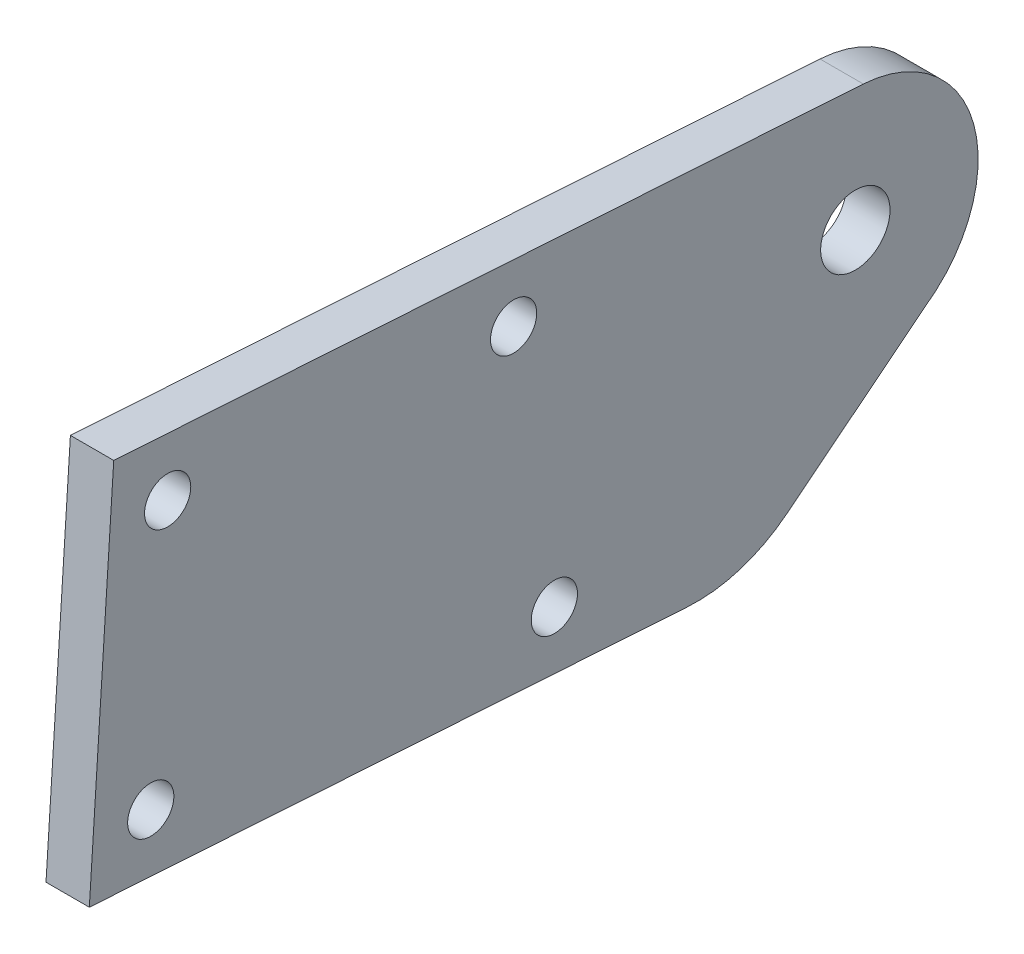
ISO-10303-21;
HEADER;
FILE_DESCRIPTION(('STEP AP214'),'2;1');
FILE_NAME('part.step','',(''),(''),'','','');
FILE_SCHEMA(('AUTOMOTIVE_DESIGN { 1 0 10303 214 1 1 1 1 }'));
ENDSEC;
DATA;
#1=APPLICATION_CONTEXT('core data for automotive mechanical design processes');
#2=APPLICATION_PROTOCOL_DEFINITION('international standard','automotive_design',2000,#1);
#3=PRODUCT_CONTEXT('',#1,'mechanical');
#4=PRODUCT('Part','Part','',(#3));
#5=PRODUCT_RELATED_PRODUCT_CATEGORY('part','',(#4));
#6=PRODUCT_DEFINITION_FORMATION('','',#4);
#7=PRODUCT_DEFINITION_CONTEXT('part definition',#1,'design');
#8=PRODUCT_DEFINITION('design','',#6,#7);
#9=PRODUCT_DEFINITION_SHAPE('','',#8);
#10=(LENGTH_UNIT() NAMED_UNIT(*) SI_UNIT(.MILLI.,.METRE.));
#11=(NAMED_UNIT(*) PLANE_ANGLE_UNIT() SI_UNIT($,.RADIAN.));
#12=(NAMED_UNIT(*) SI_UNIT($,.STERADIAN.) SOLID_ANGLE_UNIT());
#13=UNCERTAINTY_MEASURE_WITH_UNIT(LENGTH_MEASURE(1.E-05),#10,'distance_accuracy_value','');
#14=(GEOMETRIC_REPRESENTATION_CONTEXT(3) GLOBAL_UNCERTAINTY_ASSIGNED_CONTEXT((#13)) GLOBAL_UNIT_ASSIGNED_CONTEXT((#10,
#11,#12)) REPRESENTATION_CONTEXT('',''));
#15=CARTESIAN_POINT('',(0.,0.,0.));
#16=DIRECTION('',(0.,0.,1.));
#17=DIRECTION('',(1.,0.,0.));
#18=AXIS2_PLACEMENT_3D('',#15,#16,#17);
#19=CARTESIAN_POINT('',(3.,-0.106760715950924,-0.0387879175808812));
#20=DIRECTION('',(1.,0.,0.));
#21=DIRECTION('',(0.,0.,-1.));
#22=AXIS2_PLACEMENT_3D('',#19,#20,#21);
#23=PLANE('',#22);
#24=CARTESIAN_POINT('',(3.,-10.4594899761032,48.7369334698677));
#25=DIRECTION('',(1.,0.,0.));
#26=DIRECTION('',(0.,0.,-1.));
#27=AXIS2_PLACEMENT_3D('',#24,#25,#26);
#28=CIRCLE('',#27,1.6);
#29=CARTESIAN_POINT('',(3.,-10.4594899761032,47.1369334698677));
#30=VERTEX_POINT('',#29);
#31=EDGE_CURVE('E195',#30,#30,#28,.T.);
#32=ORIENTED_EDGE('',*,*,#31,.F.);
#33=EDGE_LOOP('',(#32));
#34=FACE_BOUND('',#33,.T.);
#35=CARTESIAN_POINT('',(3.,7.50247542921498,47.5674041721783));
#36=DIRECTION('',(1.,0.,0.));
#37=DIRECTION('',(0.,0.,-1.));
#38=AXIS2_PLACEMENT_3D('',#35,#36,#37);
#39=CIRCLE('',#38,1.60000000000002);
#40=CARTESIAN_POINT('',(3.,7.50247542921498,45.9674041721783));
#41=VERTEX_POINT('',#40);
#42=EDGE_CURVE('E207',#41,#41,#39,.T.);
#43=ORIENTED_EDGE('',*,*,#42,.F.);
#44=EDGE_LOOP('',(#43));
#45=FACE_BOUND('',#44,.T.);
#46=DIRECTION('',(0.,0.0649738498715913,0.997886966962122));
#47=VECTOR('',#46,1.);
#48=CARTESIAN_POINT('',(3.,11.7539186965499,51.2990566405408));
#49=LINE('',#48,#47);
#50=CARTESIAN_POINT('',(3.,8.37527850322711,-0.591065641489519));
#51=VERTEX_POINT('',#50);
#52=CARTESIAN_POINT('',(3.,11.7539186965499,51.2990566405408));
#53=VERTEX_POINT('',#52);
#54=EDGE_CURVE('E131',#51,#53,#49,.T.);
#55=ORIENTED_EDGE('',*,*,#54,.T.);
#56=DIRECTION('',(0.,-0.997886966962122,0.0649738498716033));
#57=VECTOR('',#56,1.);
#58=CARTESIAN_POINT('',(3.,11.7539186965499,51.2990566405408));
#59=LINE('',#58,#57);
#60=CARTESIAN_POINT('',(3.,-14.1911424444653,52.9883767372025));
#61=VERTEX_POINT('',#60);
#62=EDGE_CURVE('E89',#53,#61,#59,.T.);
#63=ORIENTED_EDGE('',*,*,#62,.T.);
#64=DIRECTION('',(0.,-0.0649738498715905,-0.997886966962122));
#65=VECTOR('',#64,1.);
#66=CARTESIAN_POINT('',(3.,-14.1911424444653,52.9883767372025));
#67=LINE('',#66,#65);
#68=CARTESIAN_POINT('',(3.,-16.8875572141363,11.5760676082744));
#69=VERTEX_POINT('',#68);
#70=EDGE_CURVE('E102',#61,#69,#67,.T.);
#71=ORIENTED_EDGE('',*,*,#70,.T.);
#72=CARTESIAN_POINT('',(3.,-6.90868754451549,10.9263291095586));
#73=DIRECTION('',(1.,0.,0.));
#74=DIRECTION('',(0.,0.,-1.));
#75=AXIS2_PLACEMENT_3D('',#72,#73,#74);
#76=CIRCLE('',#75,9.9999999999996);
#77=CARTESIAN_POINT('',(3.,-14.7317466496103,4.69738487813494));
#78=VERTEX_POINT('',#77);
#79=EDGE_CURVE('E96',#69,#78,#76,.T.);
#80=ORIENTED_EDGE('',*,*,#79,.T.);
#81=DIRECTION('',(0.,0.622894423142384,-0.782305910509512));
#82=VECTOR('',#81,1.);
#83=CARTESIAN_POINT('',(3.,-14.7317466496103,4.69738487813494));
#84=LINE('',#83,#82);
#85=CARTESIAN_POINT('',(3.,-6.50684666475155,-5.63243608742181));
#86=VERTEX_POINT('',#85);
#87=EDGE_CURVE('E100',#78,#86,#84,.T.);
#88=ORIENTED_EDGE('',*,*,#87,.T.);
#89=CARTESIAN_POINT('',(3.,-0.106760715950924,-0.0387879175808812));
#90=DIRECTION('',(1.,0.,0.));
#91=DIRECTION('',(0.,0.,-1.));
#92=AXIS2_PLACEMENT_3D('',#89,#90,#91);
#93=CIRCLE('',#92,8.5);
#94=EDGE_CURVE('E52',#86,#51,#93,.T.);
#95=ORIENTED_EDGE('',*,*,#94,.T.);
#96=EDGE_LOOP('',(#55,#63,#71,#80,#88,#95));
#97=FACE_BOUND('',#96,.T.);
#98=CARTESIAN_POINT('',(3.,-0.106760715950924,-0.0387879175808812));
#99=DIRECTION('',(1.,0.,0.));
#100=DIRECTION('',(0.,0.,-1.));
#101=AXIS2_PLACEMENT_3D('',#98,#99,#100);
#102=CIRCLE('',#101,2.40000000000007);
#103=CARTESIAN_POINT('',(3.,-0.106760715950924,-2.43878791758095));
#104=VERTEX_POINT('',#103);
#105=EDGE_CURVE('E124',#104,#104,#102,.T.);
#106=ORIENTED_EDGE('',*,*,#105,.F.);
#107=EDGE_LOOP('',(#106));
#108=FACE_BOUND('',#107,.T.);
#109=CARTESIAN_POINT('',(3.,5.94310303229625,23.6181169650874));
#110=DIRECTION('',(1.,0.,0.));
#111=DIRECTION('',(0.,0.,-1.));
#112=AXIS2_PLACEMENT_3D('',#109,#110,#111);
#113=CIRCLE('',#112,1.60000000000002);
#114=CARTESIAN_POINT('',(3.,5.94310303229625,22.0181169650874));
#115=VERTEX_POINT('',#114);
#116=EDGE_CURVE('E201',#115,#115,#113,.T.);
#117=ORIENTED_EDGE('',*,*,#116,.F.);
#118=EDGE_LOOP('',(#117));
#119=FACE_BOUND('',#118,.T.);
#120=CARTESIAN_POINT('',(3.,-12.2787577725077,20.7960983949283));
#121=DIRECTION('',(1.,0.,0.));
#122=DIRECTION('',(0.,0.,-1.));
#123=AXIS2_PLACEMENT_3D('',#120,#121,#122);
#124=CIRCLE('',#123,1.6);
#125=CARTESIAN_POINT('',(3.,-12.2787577725077,19.1960983949283));
#126=VERTEX_POINT('',#125);
#127=EDGE_CURVE('E186',#126,#126,#124,.T.);
#128=ORIENTED_EDGE('',*,*,#127,.F.);
#129=EDGE_LOOP('',(#128));
#130=FACE_BOUND('',#129,.T.);
#131=ADVANCED_FACE('F35',(#34,#45,#97,#108,#119,#130),#23,.T.);
#132=CARTESIAN_POINT('',(0.,-0.106760715950924,-0.0387879175808812));
#133=DIRECTION('',(1.,0.,0.));
#134=DIRECTION('',(0.,0.,-1.));
#135=AXIS2_PLACEMENT_3D('',#132,#133,#134);
#136=PLANE('',#135);
#137=DIRECTION('',(0.,0.0649738498715913,0.997886966962122));
#138=VECTOR('',#137,1.);
#139=CARTESIAN_POINT('',(0.,11.7539186965499,51.2990566405408));
#140=LINE('',#139,#138);
#141=CARTESIAN_POINT('',(0.,8.37527850322711,-0.591065641489519));
#142=VERTEX_POINT('',#141);
#143=CARTESIAN_POINT('',(0.,11.7539186965499,51.2990566405408));
#144=VERTEX_POINT('',#143);
#145=EDGE_CURVE('E120',#142,#144,#140,.T.);
#146=ORIENTED_EDGE('',*,*,#145,.F.);
#147=CARTESIAN_POINT('',(0.,-0.106760715950924,-0.0387879175808812));
#148=DIRECTION('',(1.,0.,0.));
#149=DIRECTION('',(0.,0.,-1.));
#150=AXIS2_PLACEMENT_3D('',#147,#148,#149);
#151=CIRCLE('',#150,8.5);
#152=CARTESIAN_POINT('',(0.,-6.50684666475155,-5.63243608742181));
#153=VERTEX_POINT('',#152);
#154=EDGE_CURVE('E81',#153,#142,#151,.T.);
#155=ORIENTED_EDGE('',*,*,#154,.F.);
#156=DIRECTION('',(0.,0.622894423142384,-0.782305910509512));
#157=VECTOR('',#156,1.);
#158=CARTESIAN_POINT('',(0.,-14.7317466496103,4.69738487813494));
#159=LINE('',#158,#157);
#160=CARTESIAN_POINT('',(0.,-14.7317466496103,4.69738487813494));
#161=VERTEX_POINT('',#160);
#162=EDGE_CURVE('E75',#161,#153,#159,.T.);
#163=ORIENTED_EDGE('',*,*,#162,.F.);
#164=CARTESIAN_POINT('',(0.,-6.90868754451549,10.9263291095586));
#165=DIRECTION('',(1.,0.,0.));
#166=DIRECTION('',(0.,0.,-1.));
#167=AXIS2_PLACEMENT_3D('',#164,#165,#166);
#168=CIRCLE('',#167,9.9999999999996);
#169=CARTESIAN_POINT('',(0.,-16.8875572141363,11.5760676082744));
#170=VERTEX_POINT('',#169);
#171=EDGE_CURVE('E110',#170,#161,#168,.T.);
#172=ORIENTED_EDGE('',*,*,#171,.F.);
#173=DIRECTION('',(0.,-0.0649738498715905,-0.997886966962122));
#174=VECTOR('',#173,1.);
#175=CARTESIAN_POINT('',(0.,-14.1911424444653,52.9883767372025));
#176=LINE('',#175,#174);
#177=CARTESIAN_POINT('',(0.,-14.1911424444653,52.9883767372025));
#178=VERTEX_POINT('',#177);
#179=EDGE_CURVE('E126',#178,#170,#176,.T.);
#180=ORIENTED_EDGE('',*,*,#179,.F.);
#181=DIRECTION('',(0.,-0.997886966962122,0.0649738498716033));
#182=VECTOR('',#181,1.);
#183=CARTESIAN_POINT('',(0.,11.7539186965499,51.2990566405408));
#184=LINE('',#183,#182);
#185=EDGE_CURVE('E123',#144,#178,#184,.T.);
#186=ORIENTED_EDGE('',*,*,#185,.F.);
#187=EDGE_LOOP('',(#146,#155,#163,#172,#180,#186));
#188=FACE_BOUND('',#187,.T.);
#189=CARTESIAN_POINT('',(0.,-0.106760715950924,-0.0387879175808812));
#190=DIRECTION('',(1.,0.,0.));
#191=DIRECTION('',(0.,0.,-1.));
#192=AXIS2_PLACEMENT_3D('',#189,#190,#191);
#193=CIRCLE('',#192,2.40000000000007);
#194=CARTESIAN_POINT('',(0.,-0.106760715950924,-2.43878791758095));
#195=VERTEX_POINT('',#194);
#196=EDGE_CURVE('E210',#195,#195,#193,.T.);
#197=ORIENTED_EDGE('',*,*,#196,.T.);
#198=EDGE_LOOP('',(#197));
#199=FACE_BOUND('',#198,.T.);
#200=CARTESIAN_POINT('',(0.,7.50247542921498,47.5674041721783));
#201=DIRECTION('',(1.,0.,0.));
#202=DIRECTION('',(0.,0.,-1.));
#203=AXIS2_PLACEMENT_3D('',#200,#201,#202);
#204=CIRCLE('',#203,1.60000000000002);
#205=CARTESIAN_POINT('',(0.,7.50247542921498,45.9674041721783));
#206=VERTEX_POINT('',#205);
#207=EDGE_CURVE('E204',#206,#206,#204,.T.);
#208=ORIENTED_EDGE('',*,*,#207,.T.);
#209=EDGE_LOOP('',(#208));
#210=FACE_BOUND('',#209,.T.);
#211=CARTESIAN_POINT('',(0.,5.94310303229625,23.6181169650874));
#212=DIRECTION('',(1.,0.,0.));
#213=DIRECTION('',(0.,0.,-1.));
#214=AXIS2_PLACEMENT_3D('',#211,#212,#213);
#215=CIRCLE('',#214,1.60000000000002);
#216=CARTESIAN_POINT('',(0.,5.94310303229625,22.0181169650874));
#217=VERTEX_POINT('',#216);
#218=EDGE_CURVE('E198',#217,#217,#215,.T.);
#219=ORIENTED_EDGE('',*,*,#218,.T.);
#220=EDGE_LOOP('',(#219));
#221=FACE_BOUND('',#220,.T.);
#222=CARTESIAN_POINT('',(0.,-10.4594899761032,48.7369334698677));
#223=DIRECTION('',(1.,0.,0.));
#224=DIRECTION('',(0.,0.,-1.));
#225=AXIS2_PLACEMENT_3D('',#222,#223,#224);
#226=CIRCLE('',#225,1.6);
#227=CARTESIAN_POINT('',(0.,-10.4594899761032,47.1369334698677));
#228=VERTEX_POINT('',#227);
#229=EDGE_CURVE('E192',#228,#228,#226,.T.);
#230=ORIENTED_EDGE('',*,*,#229,.T.);
#231=EDGE_LOOP('',(#230));
#232=FACE_BOUND('',#231,.T.);
#233=CARTESIAN_POINT('',(0.,-12.2787577725077,20.7960983949283));
#234=DIRECTION('',(1.,0.,0.));
#235=DIRECTION('',(0.,0.,-1.));
#236=AXIS2_PLACEMENT_3D('',#233,#234,#235);
#237=CIRCLE('',#236,1.6);
#238=CARTESIAN_POINT('',(0.,-12.2787577725077,19.1960983949283));
#239=VERTEX_POINT('',#238);
#240=EDGE_CURVE('E189',#239,#239,#237,.T.);
#241=ORIENTED_EDGE('',*,*,#240,.T.);
#242=EDGE_LOOP('',(#241));
#243=FACE_BOUND('',#242,.T.);
#244=ADVANCED_FACE('F140',(#188,#199,#210,#221,#232,#243),#136,.F.);
#245=CARTESIAN_POINT('',(3.,11.7539186965499,51.2990566405408));
#246=DIRECTION('',(0.,-0.997886966962122,0.0649738498715913));
#247=DIRECTION('',(0.,-0.0649738498715913,-0.997886966962122));
#248=AXIS2_PLACEMENT_3D('',#245,#246,#247);
#249=PLANE('',#248);
#250=ORIENTED_EDGE('',*,*,#145,.T.);
#251=DIRECTION('',(-1.,0.,0.));
#252=VECTOR('',#251,1.);
#253=CARTESIAN_POINT('',(3.,11.7539186965499,51.2990566405408));
#254=LINE('',#253,#252);
#255=EDGE_CURVE('E11',#53,#144,#254,.T.);
#256=ORIENTED_EDGE('',*,*,#255,.F.);
#257=ORIENTED_EDGE('',*,*,#54,.F.);
#258=DIRECTION('',(-1.,0.,0.));
#259=VECTOR('',#258,1.);
#260=CARTESIAN_POINT('',(3.,8.37527850322711,-0.591065641489519));
#261=LINE('',#260,#259);
#262=EDGE_CURVE('E116',#51,#142,#261,.T.);
#263=ORIENTED_EDGE('',*,*,#262,.T.);
#264=EDGE_LOOP('',(#250,#256,#257,#263));
#265=FACE_BOUND('',#264,.T.);
#266=ADVANCED_FACE('F37',(#265),#249,.F.);
#267=CARTESIAN_POINT('',(3.,11.7539186965499,51.2990566405408));
#268=DIRECTION('',(0.,-0.0649738498716033,-0.997886966962122));
#269=DIRECTION('',(0.,0.997886966962122,-0.0649738498716033));
#270=AXIS2_PLACEMENT_3D('',#267,#268,#269);
#271=PLANE('',#270);
#272=ORIENTED_EDGE('',*,*,#185,.T.);
#273=DIRECTION('',(-1.,0.,0.));
#274=VECTOR('',#273,1.);
#275=CARTESIAN_POINT('',(3.,-14.1911424444653,52.9883767372025));
#276=LINE('',#275,#274);
#277=EDGE_CURVE('E44',#61,#178,#276,.T.);
#278=ORIENTED_EDGE('',*,*,#277,.F.);
#279=ORIENTED_EDGE('',*,*,#62,.F.);
#280=ORIENTED_EDGE('',*,*,#255,.T.);
#281=EDGE_LOOP('',(#272,#278,#279,#280));
#282=FACE_BOUND('',#281,.T.);
#283=ADVANCED_FACE('F277',(#282),#271,.F.);
#284=CARTESIAN_POINT('',(3.,-14.1911424444653,52.9883767372025));
#285=DIRECTION('',(0.,0.997886966962122,-0.0649738498715905));
#286=DIRECTION('',(0.,0.0649738498715905,0.997886966962123));
#287=AXIS2_PLACEMENT_3D('',#284,#285,#286);
#288=PLANE('',#287);
#289=ORIENTED_EDGE('',*,*,#179,.T.);
#290=DIRECTION('',(-1.,0.,0.));
#291=VECTOR('',#290,1.);
#292=CARTESIAN_POINT('',(3.,-16.8875572141363,11.5760676082744));
#293=LINE('',#292,#291);
#294=EDGE_CURVE('E111',#69,#170,#293,.T.);
#295=ORIENTED_EDGE('',*,*,#294,.F.);
#296=ORIENTED_EDGE('',*,*,#70,.F.);
#297=ORIENTED_EDGE('',*,*,#277,.T.);
#298=EDGE_LOOP('',(#289,#295,#296,#297));
#299=FACE_BOUND('',#298,.T.);
#300=ADVANCED_FACE('F137',(#299),#288,.F.);
#301=CARTESIAN_POINT('',(3.,-6.90868754451549,10.9263291095586));
#302=DIRECTION('',(-1.,0.,0.));
#303=DIRECTION('',(0.,0.,1.));
#304=AXIS2_PLACEMENT_3D('',#301,#302,#303);
#305=CYLINDRICAL_SURFACE('',#304,9.9999999999996);
#306=ORIENTED_EDGE('',*,*,#171,.T.);
#307=DIRECTION('',(-1.,0.,0.));
#308=VECTOR('',#307,1.);
#309=CARTESIAN_POINT('',(3.,-14.7317466496103,4.69738487813494));
#310=LINE('',#309,#308);
#311=EDGE_CURVE('E107',#78,#161,#310,.T.);
#312=ORIENTED_EDGE('',*,*,#311,.F.);
#313=ORIENTED_EDGE('',*,*,#79,.F.);
#314=ORIENTED_EDGE('',*,*,#294,.T.);
#315=EDGE_LOOP('',(#306,#312,#313,#314));
#316=FACE_BOUND('',#315,.T.);
#317=ADVANCED_FACE('F108',(#316),#305,.T.);
#318=CARTESIAN_POINT('',(3.,-14.7317466496103,4.69738487813494));
#319=DIRECTION('',(0.,0.782305910509512,0.622894423142384));
#320=DIRECTION('',(0.,-0.622894423142384,0.782305910509512));
#321=AXIS2_PLACEMENT_3D('',#318,#319,#320);
#322=PLANE('',#321);
#323=ORIENTED_EDGE('',*,*,#162,.T.);
#324=DIRECTION('',(-1.,0.,0.));
#325=VECTOR('',#324,1.);
#326=CARTESIAN_POINT('',(3.,-6.50684666475155,-5.63243608742181));
#327=LINE('',#326,#325);
#328=EDGE_CURVE('E112',#86,#153,#327,.T.);
#329=ORIENTED_EDGE('',*,*,#328,.F.);
#330=ORIENTED_EDGE('',*,*,#87,.F.);
#331=ORIENTED_EDGE('',*,*,#311,.T.);
#332=EDGE_LOOP('',(#323,#329,#330,#331));
#333=FACE_BOUND('',#332,.T.);
#334=ADVANCED_FACE('F114',(#333),#322,.F.);
#335=CARTESIAN_POINT('',(3.,-0.106760715950924,-0.0387879175808812));
#336=DIRECTION('',(-1.,0.,0.));
#337=DIRECTION('',(0.,0.,1.));
#338=AXIS2_PLACEMENT_3D('',#335,#336,#337);
#339=CYLINDRICAL_SURFACE('',#338,8.5);
#340=ORIENTED_EDGE('',*,*,#154,.T.);
#341=ORIENTED_EDGE('',*,*,#262,.F.);
#342=ORIENTED_EDGE('',*,*,#94,.F.);
#343=ORIENTED_EDGE('',*,*,#328,.T.);
#344=EDGE_LOOP('',(#340,#341,#342,#343));
#345=FACE_BOUND('',#344,.T.);
#346=ADVANCED_FACE('F145',(#345),#339,.T.);
#347=CARTESIAN_POINT('',(3.,-0.106760715950924,-0.0387879175808812));
#348=DIRECTION('',(-1.,0.,0.));
#349=DIRECTION('',(0.,0.,1.));
#350=AXIS2_PLACEMENT_3D('',#347,#348,#349);
#351=CYLINDRICAL_SURFACE('',#350,2.40000000000007);
#352=ORIENTED_EDGE('',*,*,#105,.T.);
#353=EDGE_LOOP('',(#352));
#354=FACE_BOUND('',#353,.T.);
#355=ORIENTED_EDGE('',*,*,#196,.F.);
#356=EDGE_LOOP('',(#355));
#357=FACE_BOUND('',#356,.T.);
#358=ADVANCED_FACE('F147',(#354,#357),#351,.F.);
#359=CARTESIAN_POINT('',(3.,7.50247542921498,47.5674041721783));
#360=DIRECTION('',(-1.,0.,0.));
#361=DIRECTION('',(0.,0.,1.));
#362=AXIS2_PLACEMENT_3D('',#359,#360,#361);
#363=CYLINDRICAL_SURFACE('',#362,1.60000000000002);
#364=ORIENTED_EDGE('',*,*,#42,.T.);
#365=EDGE_LOOP('',(#364));
#366=FACE_BOUND('',#365,.T.);
#367=ORIENTED_EDGE('',*,*,#207,.F.);
#368=EDGE_LOOP('',(#367));
#369=FACE_BOUND('',#368,.T.);
#370=ADVANCED_FACE('F153',(#366,#369),#363,.F.);
#371=CARTESIAN_POINT('',(3.,5.94310303229625,23.6181169650874));
#372=DIRECTION('',(-1.,0.,0.));
#373=DIRECTION('',(0.,0.,1.));
#374=AXIS2_PLACEMENT_3D('',#371,#372,#373);
#375=CYLINDRICAL_SURFACE('',#374,1.60000000000002);
#376=ORIENTED_EDGE('',*,*,#116,.T.);
#377=EDGE_LOOP('',(#376));
#378=FACE_BOUND('',#377,.T.);
#379=ORIENTED_EDGE('',*,*,#218,.F.);
#380=EDGE_LOOP('',(#379));
#381=FACE_BOUND('',#380,.T.);
#382=ADVANCED_FACE('F169',(#378,#381),#375,.F.);
#383=CARTESIAN_POINT('',(3.,-10.4594899761032,48.7369334698677));
#384=DIRECTION('',(-1.,0.,0.));
#385=DIRECTION('',(0.,0.,1.));
#386=AXIS2_PLACEMENT_3D('',#383,#384,#385);
#387=CYLINDRICAL_SURFACE('',#386,1.6);
#388=ORIENTED_EDGE('',*,*,#31,.T.);
#389=EDGE_LOOP('',(#388));
#390=FACE_BOUND('',#389,.T.);
#391=ORIENTED_EDGE('',*,*,#229,.F.);
#392=EDGE_LOOP('',(#391));
#393=FACE_BOUND('',#392,.T.);
#394=ADVANCED_FACE('F173',(#390,#393),#387,.F.);
#395=CARTESIAN_POINT('',(3.,-12.2787577725077,20.7960983949283));
#396=DIRECTION('',(-1.,0.,0.));
#397=DIRECTION('',(0.,0.,1.));
#398=AXIS2_PLACEMENT_3D('',#395,#396,#397);
#399=CYLINDRICAL_SURFACE('',#398,1.6);
#400=ORIENTED_EDGE('',*,*,#127,.T.);
#401=EDGE_LOOP('',(#400));
#402=FACE_BOUND('',#401,.T.);
#403=ORIENTED_EDGE('',*,*,#240,.F.);
#404=EDGE_LOOP('',(#403));
#405=FACE_BOUND('',#404,.T.);
#406=ADVANCED_FACE('F177',(#402,#405),#399,.F.);
#407=CLOSED_SHELL('',(#131,#244,#266,#283,#300,#317,#334,#346,#358,#370,#382,#394,#406));
#408=MANIFOLD_SOLID_BREP('B2',#407);
#409=ADVANCED_BREP_SHAPE_REPRESENTATION('',(#18,#408),#14);
#410=SHAPE_DEFINITION_REPRESENTATION(#9,#409);
ENDSEC;
END-ISO-10303-21;
